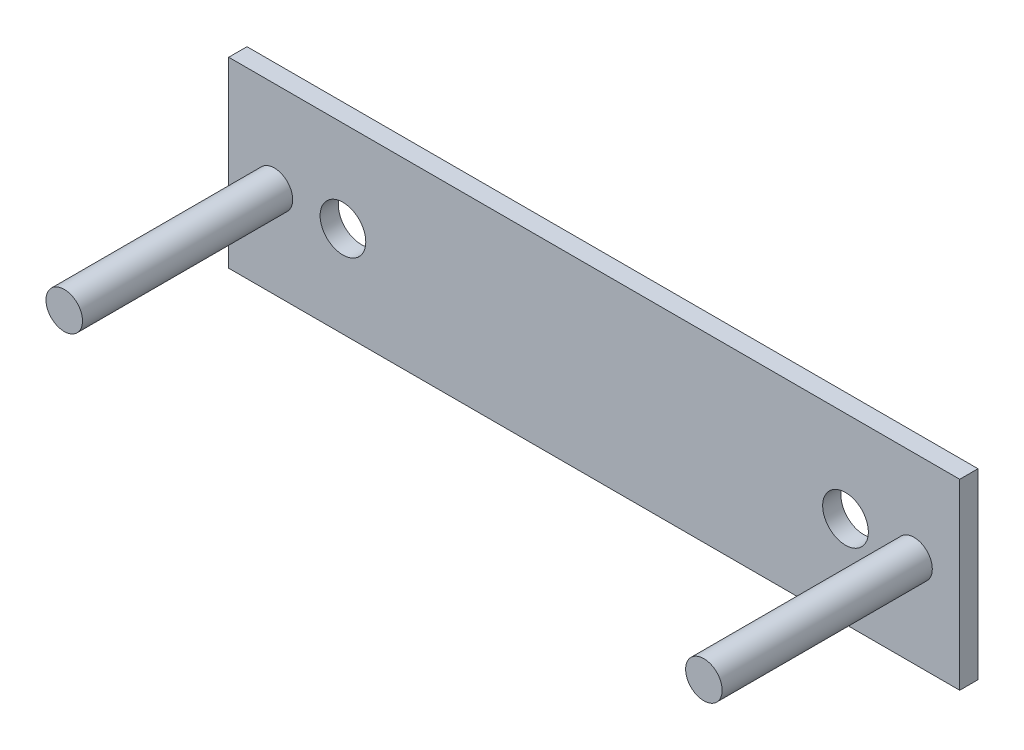
ISO-10303-21;
HEADER;
FILE_DESCRIPTION(('STEP AP214'),'2;1');
FILE_NAME('part.step','',(''),(''),'','','');
FILE_SCHEMA(('AUTOMOTIVE_DESIGN { 1 0 10303 214 1 1 1 1 }'));
ENDSEC;
DATA;
#1=APPLICATION_CONTEXT('core data for automotive mechanical design processes');
#2=APPLICATION_PROTOCOL_DEFINITION('international standard','automotive_design',2000,#1);
#3=PRODUCT_CONTEXT('',#1,'mechanical');
#4=PRODUCT('Part','Part','',(#3));
#5=PRODUCT_RELATED_PRODUCT_CATEGORY('part','',(#4));
#6=PRODUCT_DEFINITION_FORMATION('','',#4);
#7=PRODUCT_DEFINITION_CONTEXT('part definition',#1,'design');
#8=PRODUCT_DEFINITION('design','',#6,#7);
#9=PRODUCT_DEFINITION_SHAPE('','',#8);
#10=(LENGTH_UNIT() NAMED_UNIT(*) SI_UNIT(.MILLI.,.METRE.));
#11=(NAMED_UNIT(*) PLANE_ANGLE_UNIT() SI_UNIT($,.RADIAN.));
#12=(NAMED_UNIT(*) SI_UNIT($,.STERADIAN.) SOLID_ANGLE_UNIT());
#13=UNCERTAINTY_MEASURE_WITH_UNIT(LENGTH_MEASURE(1.E-05),#10,'distance_accuracy_value','');
#14=(GEOMETRIC_REPRESENTATION_CONTEXT(3) GLOBAL_UNCERTAINTY_ASSIGNED_CONTEXT((#13)) GLOBAL_UNIT_ASSIGNED_CONTEXT((#10,
#11,#12)) REPRESENTATION_CONTEXT('',''));
#15=CARTESIAN_POINT('',(0.,0.,0.));
#16=DIRECTION('',(0.,0.,1.));
#17=DIRECTION('',(1.,0.,0.));
#18=AXIS2_PLACEMENT_3D('',#15,#16,#17);
#19=CARTESIAN_POINT('',(0.,0.,2.));
#20=DIRECTION('',(0.,0.,1.));
#21=DIRECTION('',(1.,0.,0.));
#22=AXIS2_PLACEMENT_3D('',#19,#20,#21);
#23=PLANE('',#22);
#24=CARTESIAN_POINT('',(-44.9257871461814,-16.3951907453172,2.));
#25=DIRECTION('',(0.,0.,1.));
#26=DIRECTION('',(1.,0.,0.));
#27=AXIS2_PLACEMENT_3D('',#24,#25,#26);
#28=CIRCLE('',#27,2.);
#29=CARTESIAN_POINT('',(-42.9257871461814,-16.3951907453172,2.));
#30=VERTEX_POINT('',#29);
#31=EDGE_CURVE('E129',#30,#30,#28,.T.);
#32=ORIENTED_EDGE('',*,*,#31,.F.);
#33=EDGE_LOOP('',(#32));
#34=FACE_BOUND('',#33,.T.);
#35=CARTESIAN_POINT('',(25.0742128538186,-16.3951907453172,2.));
#36=DIRECTION('',(0.,0.,1.));
#37=DIRECTION('',(1.,0.,0.));
#38=AXIS2_PLACEMENT_3D('',#35,#36,#37);
#39=CIRCLE('',#38,2.);
#40=CARTESIAN_POINT('',(27.0742128538186,-16.3951907453172,2.));
#41=VERTEX_POINT('',#40);
#42=EDGE_CURVE('E123',#41,#41,#39,.T.);
#43=ORIENTED_EDGE('',*,*,#42,.F.);
#44=EDGE_LOOP('',(#43));
#45=FACE_BOUND('',#44,.T.);
#46=CARTESIAN_POINT('',(-37.4257871461814,-16.3951907453172,2.));
#47=DIRECTION('',(0.,0.,1.));
#48=DIRECTION('',(1.,0.,0.));
#49=AXIS2_PLACEMENT_3D('',#46,#47,#48);
#50=CIRCLE('',#49,2.5);
#51=CARTESIAN_POINT('',(-34.9257871461814,-16.3951907453172,2.));
#52=VERTEX_POINT('',#51);
#53=EDGE_CURVE('E99',#52,#52,#50,.T.);
#54=ORIENTED_EDGE('',*,*,#53,.F.);
#55=EDGE_LOOP('',(#54));
#56=FACE_BOUND('',#55,.T.);
#57=DIRECTION('',(0.,-1.,0.));
#58=VECTOR('',#57,1.);
#59=CARTESIAN_POINT('',(-49.9257871461814,-6.39519074531721,2.));
#60=LINE('',#59,#58);
#61=CARTESIAN_POINT('',(-49.9257871461814,-6.39519074531721,2.));
#62=VERTEX_POINT('',#61);
#63=CARTESIAN_POINT('',(-49.9257871461814,-26.3951907453172,2.));
#64=VERTEX_POINT('',#63);
#65=EDGE_CURVE('E84',#62,#64,#60,.T.);
#66=ORIENTED_EDGE('',*,*,#65,.T.);
#67=DIRECTION('',(1.,0.,0.));
#68=VECTOR('',#67,1.);
#69=CARTESIAN_POINT('',(-49.9257871461814,-26.3951907453172,2.));
#70=LINE('',#69,#68);
#71=CARTESIAN_POINT('',(30.0742128538186,-26.3951907453172,2.));
#72=VERTEX_POINT('',#71);
#73=EDGE_CURVE('E79',#64,#72,#70,.T.);
#74=ORIENTED_EDGE('',*,*,#73,.T.);
#75=DIRECTION('',(0.,1.,0.));
#76=VECTOR('',#75,1.);
#77=CARTESIAN_POINT('',(30.0742128538186,-6.39519074531721,2.));
#78=LINE('',#77,#76);
#79=CARTESIAN_POINT('',(30.0742128538186,-6.39519074531721,2.));
#80=VERTEX_POINT('',#79);
#81=EDGE_CURVE('E82',#72,#80,#78,.T.);
#82=ORIENTED_EDGE('',*,*,#81,.T.);
#83=DIRECTION('',(-1.,0.,0.));
#84=VECTOR('',#83,1.);
#85=CARTESIAN_POINT('',(-49.9257871461814,-6.39519074531721,2.));
#86=LINE('',#85,#84);
#87=EDGE_CURVE('E49',#80,#62,#86,.T.);
#88=ORIENTED_EDGE('',*,*,#87,.T.);
#89=EDGE_LOOP('',(#66,#74,#82,#88));
#90=FACE_BOUND('',#89,.T.);
#91=CARTESIAN_POINT('',(17.5742128538186,-16.3951907453172,2.));
#92=DIRECTION('',(0.,0.,1.));
#93=DIRECTION('',(1.,0.,0.));
#94=AXIS2_PLACEMENT_3D('',#91,#92,#93);
#95=CIRCLE('',#94,2.5);
#96=CARTESIAN_POINT('',(20.0742128538186,-16.3951907453172,2.));
#97=VERTEX_POINT('',#96);
#98=EDGE_CURVE('E114',#97,#97,#95,.T.);
#99=ORIENTED_EDGE('',*,*,#98,.F.);
#100=EDGE_LOOP('',(#99));
#101=FACE_BOUND('',#100,.T.);
#102=ADVANCED_FACE('F32',(#34,#45,#56,#90,#101),#23,.T.);
#103=CARTESIAN_POINT('',(0.,0.,0.));
#104=DIRECTION('',(0.,0.,1.));
#105=DIRECTION('',(1.,0.,0.));
#106=AXIS2_PLACEMENT_3D('',#103,#104,#105);
#107=PLANE('',#106);
#108=DIRECTION('',(0.,-1.,0.));
#109=VECTOR('',#108,1.);
#110=CARTESIAN_POINT('',(-49.9257871461814,-6.39519074531721,0.));
#111=LINE('',#110,#109);
#112=CARTESIAN_POINT('',(-49.9257871461814,-6.39519074531721,0.));
#113=VERTEX_POINT('',#112);
#114=CARTESIAN_POINT('',(-49.9257871461814,-26.3951907453172,0.));
#115=VERTEX_POINT('',#114);
#116=EDGE_CURVE('E96',#113,#115,#111,.T.);
#117=ORIENTED_EDGE('',*,*,#116,.F.);
#118=DIRECTION('',(-1.,0.,0.));
#119=VECTOR('',#118,1.);
#120=CARTESIAN_POINT('',(-49.9257871461814,-6.39519074531721,0.));
#121=LINE('',#120,#119);
#122=CARTESIAN_POINT('',(30.0742128538186,-6.39519074531721,0.));
#123=VERTEX_POINT('',#122);
#124=EDGE_CURVE('E72',#123,#113,#121,.T.);
#125=ORIENTED_EDGE('',*,*,#124,.F.);
#126=DIRECTION('',(0.,1.,0.));
#127=VECTOR('',#126,1.);
#128=CARTESIAN_POINT('',(30.0742128538186,-6.39519074531721,0.));
#129=LINE('',#128,#127);
#130=CARTESIAN_POINT('',(30.0742128538186,-26.3951907453172,0.));
#131=VERTEX_POINT('',#130);
#132=EDGE_CURVE('E66',#131,#123,#129,.T.);
#133=ORIENTED_EDGE('',*,*,#132,.F.);
#134=DIRECTION('',(1.,0.,0.));
#135=VECTOR('',#134,1.);
#136=CARTESIAN_POINT('',(-49.9257871461814,-26.3951907453172,0.));
#137=LINE('',#136,#135);
#138=EDGE_CURVE('E88',#115,#131,#137,.T.);
#139=ORIENTED_EDGE('',*,*,#138,.F.);
#140=EDGE_LOOP('',(#117,#125,#133,#139));
#141=FACE_BOUND('',#140,.T.);
#142=CARTESIAN_POINT('',(-37.4257871461814,-16.3951907453172,0.));
#143=DIRECTION('',(0.,0.,1.));
#144=DIRECTION('',(1.,0.,0.));
#145=AXIS2_PLACEMENT_3D('',#142,#143,#144);
#146=CIRCLE('',#145,2.5);
#147=CARTESIAN_POINT('',(-34.9257871461814,-16.3951907453172,0.));
#148=VERTEX_POINT('',#147);
#149=EDGE_CURVE('E111',#148,#148,#146,.T.);
#150=ORIENTED_EDGE('',*,*,#149,.T.);
#151=EDGE_LOOP('',(#150));
#152=FACE_BOUND('',#151,.T.);
#153=CARTESIAN_POINT('',(17.5742128538186,-16.3951907453172,0.));
#154=DIRECTION('',(0.,0.,1.));
#155=DIRECTION('',(1.,0.,0.));
#156=AXIS2_PLACEMENT_3D('',#153,#154,#155);
#157=CIRCLE('',#156,2.5);
#158=CARTESIAN_POINT('',(20.0742128538186,-16.3951907453172,0.));
#159=VERTEX_POINT('',#158);
#160=EDGE_CURVE('E117',#159,#159,#157,.T.);
#161=ORIENTED_EDGE('',*,*,#160,.T.);
#162=EDGE_LOOP('',(#161));
#163=FACE_BOUND('',#162,.T.);
#164=ADVANCED_FACE('F107',(#141,#152,#163),#107,.F.);
#165=CARTESIAN_POINT('',(-49.9257871461814,-6.39519074531721,2.));
#166=DIRECTION('',(1.,0.,0.));
#167=DIRECTION('',(0.,1.,0.));
#168=AXIS2_PLACEMENT_3D('',#165,#166,#167);
#169=PLANE('',#168);
#170=ORIENTED_EDGE('',*,*,#116,.T.);
#171=DIRECTION('',(0.,0.,-1.));
#172=VECTOR('',#171,1.);
#173=CARTESIAN_POINT('',(-49.9257871461814,-26.3951907453172,2.));
#174=LINE('',#173,#172);
#175=EDGE_CURVE('E11',#64,#115,#174,.T.);
#176=ORIENTED_EDGE('',*,*,#175,.F.);
#177=ORIENTED_EDGE('',*,*,#65,.F.);
#178=DIRECTION('',(0.,0.,-1.));
#179=VECTOR('',#178,1.);
#180=CARTESIAN_POINT('',(-49.9257871461814,-6.39519074531721,2.));
#181=LINE('',#180,#179);
#182=EDGE_CURVE('E92',#62,#113,#181,.T.);
#183=ORIENTED_EDGE('',*,*,#182,.T.);
#184=EDGE_LOOP('',(#170,#176,#177,#183));
#185=FACE_BOUND('',#184,.T.);
#186=ADVANCED_FACE('F34',(#185),#169,.F.);
#187=CARTESIAN_POINT('',(-49.9257871461814,-26.3951907453172,2.));
#188=DIRECTION('',(0.,1.,0.));
#189=DIRECTION('',(0.,0.,1.));
#190=AXIS2_PLACEMENT_3D('',#187,#188,#189);
#191=PLANE('',#190);
#192=ORIENTED_EDGE('',*,*,#138,.T.);
#193=DIRECTION('',(0.,0.,-1.));
#194=VECTOR('',#193,1.);
#195=CARTESIAN_POINT('',(30.0742128538186,-26.3951907453172,2.));
#196=LINE('',#195,#194);
#197=EDGE_CURVE('E41',#72,#131,#196,.T.);
#198=ORIENTED_EDGE('',*,*,#197,.F.);
#199=ORIENTED_EDGE('',*,*,#73,.F.);
#200=ORIENTED_EDGE('',*,*,#175,.T.);
#201=EDGE_LOOP('',(#192,#198,#199,#200));
#202=FACE_BOUND('',#201,.T.);
#203=ADVANCED_FACE('F87',(#202),#191,.F.);
#204=CARTESIAN_POINT('',(30.0742128538186,-6.39519074531721,2.));
#205=DIRECTION('',(-1.,0.,0.));
#206=DIRECTION('',(0.,-1.,0.));
#207=AXIS2_PLACEMENT_3D('',#204,#205,#206);
#208=PLANE('',#207);
#209=ORIENTED_EDGE('',*,*,#132,.T.);
#210=DIRECTION('',(0.,0.,-1.));
#211=VECTOR('',#210,1.);
#212=CARTESIAN_POINT('',(30.0742128538186,-6.39519074531721,2.));
#213=LINE('',#212,#211);
#214=EDGE_CURVE('E89',#80,#123,#213,.T.);
#215=ORIENTED_EDGE('',*,*,#214,.F.);
#216=ORIENTED_EDGE('',*,*,#81,.F.);
#217=ORIENTED_EDGE('',*,*,#197,.T.);
#218=EDGE_LOOP('',(#209,#215,#216,#217));
#219=FACE_BOUND('',#218,.T.);
#220=ADVANCED_FACE('F90',(#219),#208,.F.);
#221=CARTESIAN_POINT('',(-49.9257871461814,-6.39519074531721,2.));
#222=DIRECTION('',(0.,-1.,0.));
#223=DIRECTION('',(0.,0.,-1.));
#224=AXIS2_PLACEMENT_3D('',#221,#222,#223);
#225=PLANE('',#224);
#226=ORIENTED_EDGE('',*,*,#124,.T.);
#227=ORIENTED_EDGE('',*,*,#182,.F.);
#228=ORIENTED_EDGE('',*,*,#87,.F.);
#229=ORIENTED_EDGE('',*,*,#214,.T.);
#230=EDGE_LOOP('',(#226,#227,#228,#229));
#231=FACE_BOUND('',#230,.T.);
#232=ADVANCED_FACE('F104',(#231),#225,.F.);
#233=CARTESIAN_POINT('',(-37.4257871461814,-16.3951907453172,2.));
#234=DIRECTION('',(0.,0.,-1.));
#235=DIRECTION('',(-1.,0.,0.));
#236=AXIS2_PLACEMENT_3D('',#233,#234,#235);
#237=CYLINDRICAL_SURFACE('',#236,2.5);
#238=ORIENTED_EDGE('',*,*,#53,.T.);
#239=EDGE_LOOP('',(#238));
#240=FACE_BOUND('',#239,.T.);
#241=ORIENTED_EDGE('',*,*,#149,.F.);
#242=EDGE_LOOP('',(#241));
#243=FACE_BOUND('',#242,.T.);
#244=ADVANCED_FACE('F151',(#240,#243),#237,.F.);
#245=CARTESIAN_POINT('',(17.5742128538186,-16.3951907453172,2.));
#246=DIRECTION('',(0.,0.,-1.));
#247=DIRECTION('',(-1.,0.,0.));
#248=AXIS2_PLACEMENT_3D('',#245,#246,#247);
#249=CYLINDRICAL_SURFACE('',#248,2.5);
#250=ORIENTED_EDGE('',*,*,#98,.T.);
#251=EDGE_LOOP('',(#250));
#252=FACE_BOUND('',#251,.T.);
#253=ORIENTED_EDGE('',*,*,#160,.F.);
#254=EDGE_LOOP('',(#253));
#255=FACE_BOUND('',#254,.T.);
#256=ADVANCED_FACE('F154',(#252,#255),#249,.F.);
#257=CARTESIAN_POINT('',(25.0742128538186,-16.3951907453172,25.));
#258=DIRECTION('',(0.,0.,-1.));
#259=DIRECTION('',(-1.,0.,0.));
#260=AXIS2_PLACEMENT_3D('',#257,#258,#259);
#261=CYLINDRICAL_SURFACE('',#260,2.);
#262=CARTESIAN_POINT('',(25.0742128538186,-16.3951907453172,25.));
#263=DIRECTION('',(0.,0.,1.));
#264=DIRECTION('',(1.,0.,0.));
#265=AXIS2_PLACEMENT_3D('',#262,#263,#264);
#266=CIRCLE('',#265,2.);
#267=CARTESIAN_POINT('',(27.0742128538186,-16.3951907453172,25.));
#268=VERTEX_POINT('',#267);
#269=EDGE_CURVE('E120',#268,#268,#266,.T.);
#270=ORIENTED_EDGE('',*,*,#269,.F.);
#271=EDGE_LOOP('',(#270));
#272=FACE_BOUND('',#271,.T.);
#273=ORIENTED_EDGE('',*,*,#42,.T.);
#274=EDGE_LOOP('',(#273));
#275=FACE_BOUND('',#274,.T.);
#276=ADVANCED_FACE('F163',(#272,#275),#261,.T.);
#277=CARTESIAN_POINT('',(25.0742128538186,-16.3951907453172,25.));
#278=DIRECTION('',(0.,0.,1.));
#279=DIRECTION('',(1.,0.,0.));
#280=AXIS2_PLACEMENT_3D('',#277,#278,#279);
#281=PLANE('',#280);
#282=ORIENTED_EDGE('',*,*,#269,.T.);
#283=EDGE_LOOP('',(#282));
#284=FACE_BOUND('',#283,.T.);
#285=ADVANCED_FACE('F140',(#284),#281,.T.);
#286=CARTESIAN_POINT('',(-44.9257871461814,-16.3951907453172,25.));
#287=DIRECTION('',(0.,0.,-1.));
#288=DIRECTION('',(-1.,0.,0.));
#289=AXIS2_PLACEMENT_3D('',#286,#287,#288);
#290=CYLINDRICAL_SURFACE('',#289,2.);
#291=CARTESIAN_POINT('',(-44.9257871461814,-16.3951907453172,25.));
#292=DIRECTION('',(0.,0.,1.));
#293=DIRECTION('',(1.,0.,0.));
#294=AXIS2_PLACEMENT_3D('',#291,#292,#293);
#295=CIRCLE('',#294,2.);
#296=CARTESIAN_POINT('',(-42.9257871461814,-16.3951907453172,25.));
#297=VERTEX_POINT('',#296);
#298=EDGE_CURVE('E126',#297,#297,#295,.T.);
#299=ORIENTED_EDGE('',*,*,#298,.F.);
#300=EDGE_LOOP('',(#299));
#301=FACE_BOUND('',#300,.T.);
#302=ORIENTED_EDGE('',*,*,#31,.T.);
#303=EDGE_LOOP('',(#302));
#304=FACE_BOUND('',#303,.T.);
#305=ADVANCED_FACE('F137',(#301,#304),#290,.T.);
#306=CARTESIAN_POINT('',(-44.9257871461814,-16.3951907453172,25.));
#307=DIRECTION('',(0.,0.,1.));
#308=DIRECTION('',(1.,0.,0.));
#309=AXIS2_PLACEMENT_3D('',#306,#307,#308);
#310=PLANE('',#309);
#311=ORIENTED_EDGE('',*,*,#298,.T.);
#312=EDGE_LOOP('',(#311));
#313=FACE_BOUND('',#312,.T.);
#314=ADVANCED_FACE('F135',(#313),#310,.T.);
#315=CLOSED_SHELL('',(#102,#164,#186,#203,#220,#232,#244,#256,#276,#285,#305,#314));
#316=MANIFOLD_SOLID_BREP('B2',#315);
#317=ADVANCED_BREP_SHAPE_REPRESENTATION('',(#18,#316),#14);
#318=SHAPE_DEFINITION_REPRESENTATION(#9,#317);
ENDSEC;
END-ISO-10303-21;
